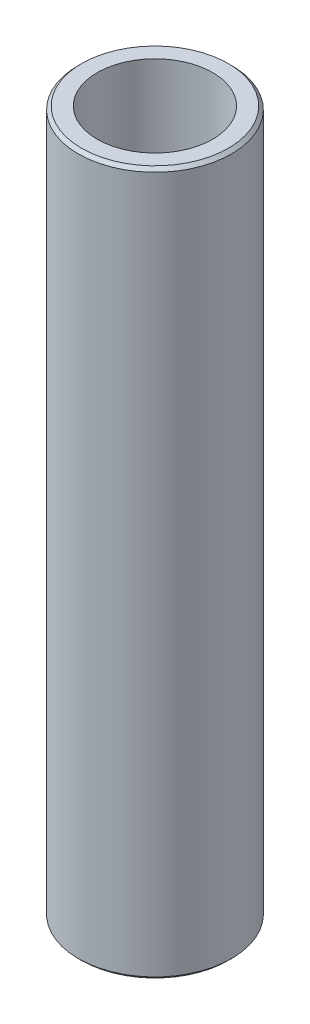
ISO-10303-21;
HEADER;
FILE_DESCRIPTION(('STEP AP214'),'2;1');
FILE_NAME('part.step','',(''),(''),'','','');
FILE_SCHEMA(('AUTOMOTIVE_DESIGN { 1 0 10303 214 1 1 1 1 }'));
ENDSEC;
DATA;
#1=APPLICATION_CONTEXT('core data for automotive mechanical design processes');
#2=APPLICATION_PROTOCOL_DEFINITION('international standard','automotive_design',2000,#1);
#3=PRODUCT_CONTEXT('',#1,'mechanical');
#4=PRODUCT('Part','Part','',(#3));
#5=PRODUCT_RELATED_PRODUCT_CATEGORY('part','',(#4));
#6=PRODUCT_DEFINITION_FORMATION('','',#4);
#7=PRODUCT_DEFINITION_CONTEXT('part definition',#1,'design');
#8=PRODUCT_DEFINITION('design','',#6,#7);
#9=PRODUCT_DEFINITION_SHAPE('','',#8);
#10=(LENGTH_UNIT() NAMED_UNIT(*) SI_UNIT(.MILLI.,.METRE.));
#11=(NAMED_UNIT(*) PLANE_ANGLE_UNIT() SI_UNIT($,.RADIAN.));
#12=(NAMED_UNIT(*) SI_UNIT($,.STERADIAN.) SOLID_ANGLE_UNIT());
#13=UNCERTAINTY_MEASURE_WITH_UNIT(LENGTH_MEASURE(1.E-05),#10,'distance_accuracy_value','');
#14=(GEOMETRIC_REPRESENTATION_CONTEXT(3) GLOBAL_UNCERTAINTY_ASSIGNED_CONTEXT((#13)) GLOBAL_UNIT_ASSIGNED_CONTEXT((#10,
#11,#12)) REPRESENTATION_CONTEXT('',''));
#15=CARTESIAN_POINT('',(0.,0.,0.));
#16=DIRECTION('',(0.,0.,1.));
#17=DIRECTION('',(1.,0.,0.));
#18=AXIS2_PLACEMENT_3D('',#15,#16,#17);
#19=CARTESIAN_POINT('',(0.,344.070552029073,0.));
#20=DIRECTION('',(0.,-1.,0.));
#21=DIRECTION('',(0.,0.,-1.));
#22=AXIS2_PLACEMENT_3D('',#19,#20,#21);
#23=CYLINDRICAL_SURFACE('',#22,37.5);
#24=CARTESIAN_POINT('',(0.,342.474361203475,0.));
#25=DIRECTION('',(0.,1.,0.));
#26=DIRECTION('',(0.,0.,1.));
#27=AXIS2_PLACEMENT_3D('',#24,#25,#26);
#28=CIRCLE('',#27,37.5);
#29=CARTESIAN_POINT('',(0.,342.474361203475,37.5));
#30=VERTEX_POINT('',#29);
#31=EDGE_CURVE('E50',#30,#30,#28,.F.);
#32=ORIENTED_EDGE('',*,*,#31,.T.);
#33=EDGE_LOOP('',(#32));
#34=FACE_BOUND('',#33,.T.);
#35=CARTESIAN_POINT('',(0.,1.59619082559825,0.));
#36=DIRECTION('',(0.,1.,0.));
#37=DIRECTION('',(0.,0.,1.));
#38=AXIS2_PLACEMENT_3D('',#35,#36,#37);
#39=CIRCLE('',#38,37.5);
#40=CARTESIAN_POINT('',(0.,1.59619082559825,37.5));
#41=VERTEX_POINT('',#40);
#42=EDGE_CURVE('E51',#41,#41,#39,.T.);
#43=ORIENTED_EDGE('',*,*,#42,.T.);
#44=EDGE_LOOP('',(#43));
#45=FACE_BOUND('',#44,.T.);
#46=ADVANCED_FACE('F39',(#34,#45),#23,.T.);
#47=CARTESIAN_POINT('',(0.,344.070552029073,0.));
#48=DIRECTION('',(0.,1.,0.));
#49=DIRECTION('',(0.,0.,1.));
#50=AXIS2_PLACEMENT_3D('',#47,#48,#49);
#51=PLANE('',#50);
#52=CARTESIAN_POINT('',(0.,344.070552029073,0.));
#53=DIRECTION('',(0.,1.,0.));
#54=DIRECTION('',(0.,0.,1.));
#55=AXIS2_PLACEMENT_3D('',#52,#53,#54);
#56=CIRCLE('',#55,35.9038091744017);
#57=CARTESIAN_POINT('',(0.,344.070552029073,35.9038091744017));
#58=VERTEX_POINT('',#57);
#59=EDGE_CURVE('E54',#58,#58,#56,.T.);
#60=ORIENTED_EDGE('',*,*,#59,.T.);
#61=EDGE_LOOP('',(#60));
#62=FACE_BOUND('',#61,.T.);
#63=CARTESIAN_POINT('',(0.,344.070552029073,0.));
#64=DIRECTION('',(0.,1.,0.));
#65=DIRECTION('',(0.,0.,1.));
#66=AXIS2_PLACEMENT_3D('',#63,#64,#65);
#67=CIRCLE('',#66,28.2471009683682);
#68=CARTESIAN_POINT('',(0.,344.070552029073,28.2471009683682));
#69=VERTEX_POINT('',#68);
#70=EDGE_CURVE('E58',#69,#69,#67,.T.);
#71=ORIENTED_EDGE('',*,*,#70,.F.);
#72=EDGE_LOOP('',(#71));
#73=FACE_BOUND('',#72,.T.);
#74=ADVANCED_FACE('F69',(#62,#73),#51,.T.);
#75=CARTESIAN_POINT('',(0.,0.,0.));
#76=DIRECTION('',(0.,1.,0.));
#77=DIRECTION('',(0.,0.,1.));
#78=AXIS2_PLACEMENT_3D('',#75,#76,#77);
#79=PLANE('',#78);
#80=CARTESIAN_POINT('',(0.,0.,0.));
#81=DIRECTION('',(0.,1.,0.));
#82=DIRECTION('',(0.,0.,1.));
#83=AXIS2_PLACEMENT_3D('',#80,#81,#82);
#84=CIRCLE('',#83,35.9038091744017);
#85=CARTESIAN_POINT('',(0.,0.,35.9038091744017));
#86=VERTEX_POINT('',#85);
#87=EDGE_CURVE('E10',#86,#86,#84,.F.);
#88=ORIENTED_EDGE('',*,*,#87,.T.);
#89=EDGE_LOOP('',(#88));
#90=FACE_BOUND('',#89,.T.);
#91=CARTESIAN_POINT('',(0.,0.,0.));
#92=DIRECTION('',(0.,1.,0.));
#93=DIRECTION('',(0.,0.,1.));
#94=AXIS2_PLACEMENT_3D('',#91,#92,#93);
#95=CIRCLE('',#94,28.2471009683682);
#96=CARTESIAN_POINT('',(0.,0.,28.2471009683682));
#97=VERTEX_POINT('',#96);
#98=EDGE_CURVE('E63',#97,#97,#95,.T.);
#99=ORIENTED_EDGE('',*,*,#98,.T.);
#100=EDGE_LOOP('',(#99));
#101=FACE_BOUND('',#100,.T.);
#102=ADVANCED_FACE('F75',(#90,#101),#79,.F.);
#103=CARTESIAN_POINT('',(0.,344.070552029073,0.));
#104=DIRECTION('',(0.,-1.,0.));
#105=DIRECTION('',(0.,0.,-1.));
#106=AXIS2_PLACEMENT_3D('',#103,#104,#105);
#107=CYLINDRICAL_SURFACE('',#106,28.2471009683682);
#108=ORIENTED_EDGE('',*,*,#70,.T.);
#109=EDGE_LOOP('',(#108));
#110=FACE_BOUND('',#109,.T.);
#111=ORIENTED_EDGE('',*,*,#98,.F.);
#112=EDGE_LOOP('',(#111));
#113=FACE_BOUND('',#112,.T.);
#114=ADVANCED_FACE('F70',(#110,#113),#107,.F.);
#115=CARTESIAN_POINT('',(0.,344.070552029073,0.));
#116=DIRECTION('',(0.,-1.,0.));
#117=DIRECTION('',(0.,0.,-1.));
#118=AXIS2_PLACEMENT_3D('',#115,#116,#117);
#119=CONICAL_SURFACE('',#118,35.9038091744017,0.785398163397457);
#120=ORIENTED_EDGE('',*,*,#31,.F.);
#121=EDGE_LOOP('',(#120));
#122=FACE_BOUND('',#121,.T.);
#123=ORIENTED_EDGE('',*,*,#59,.F.);
#124=EDGE_LOOP('',(#123));
#125=FACE_BOUND('',#124,.T.);
#126=ADVANCED_FACE('F81',(#122,#125),#119,.T.);
#127=CARTESIAN_POINT('',(0.,1.59619082559825,0.));
#128=DIRECTION('',(0.,1.,0.));
#129=DIRECTION('',(0.,0.,1.));
#130=AXIS2_PLACEMENT_3D('',#127,#128,#129);
#131=CONICAL_SURFACE('',#130,37.5,0.785398163397474);
#132=ORIENTED_EDGE('',*,*,#87,.F.);
#133=EDGE_LOOP('',(#132));
#134=FACE_BOUND('',#133,.T.);
#135=ORIENTED_EDGE('',*,*,#42,.F.);
#136=EDGE_LOOP('',(#135));
#137=FACE_BOUND('',#136,.T.);
#138=ADVANCED_FACE('F45',(#134,#137),#131,.T.);
#139=CLOSED_SHELL('',(#46,#74,#102,#114,#126,#138));
#140=MANIFOLD_SOLID_BREP('B2',#139);
#141=ADVANCED_BREP_SHAPE_REPRESENTATION('',(#18,#140),#14);
#142=SHAPE_DEFINITION_REPRESENTATION(#9,#141);
ENDSEC;
END-ISO-10303-21;
